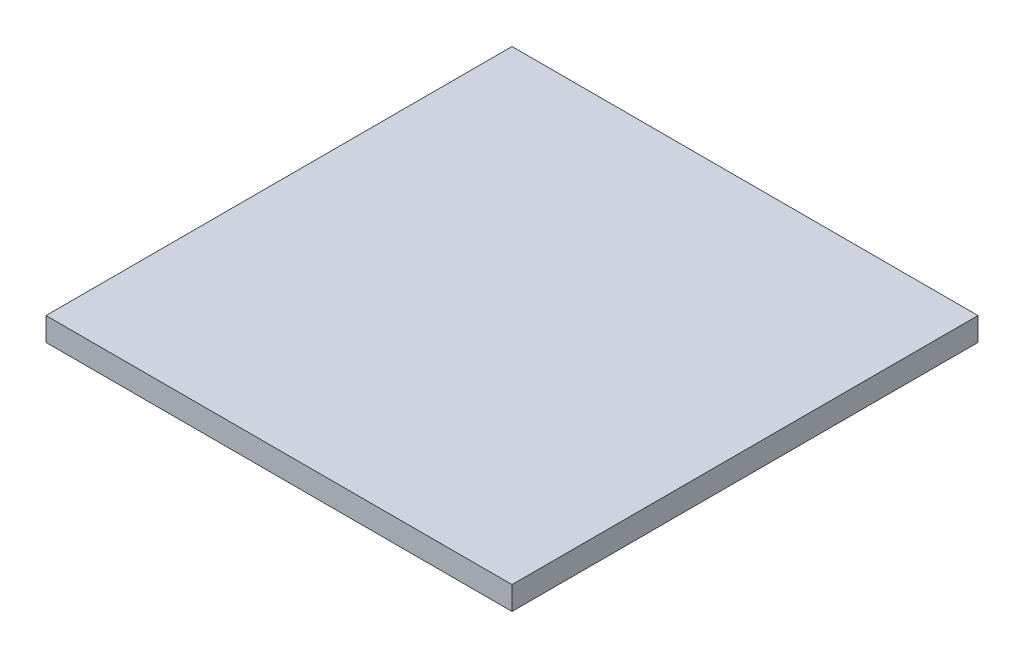
ISO-10303-21;
HEADER;
FILE_DESCRIPTION(('STEP AP214'),'2;1');
FILE_NAME('part.step','',(''),(''),'','','');
FILE_SCHEMA(('AUTOMOTIVE_DESIGN { 1 0 10303 214 1 1 1 1 }'));
ENDSEC;
DATA;
#1=APPLICATION_CONTEXT('core data for automotive mechanical design processes');
#2=APPLICATION_PROTOCOL_DEFINITION('international standard','automotive_design',2000,#1);
#3=PRODUCT_CONTEXT('',#1,'mechanical');
#4=PRODUCT('Part','Part','',(#3));
#5=PRODUCT_RELATED_PRODUCT_CATEGORY('part','',(#4));
#6=PRODUCT_DEFINITION_FORMATION('','',#4);
#7=PRODUCT_DEFINITION_CONTEXT('part definition',#1,'design');
#8=PRODUCT_DEFINITION('design','',#6,#7);
#9=PRODUCT_DEFINITION_SHAPE('','',#8);
#10=(LENGTH_UNIT() NAMED_UNIT(*) SI_UNIT(.MILLI.,.METRE.));
#11=(NAMED_UNIT(*) PLANE_ANGLE_UNIT() SI_UNIT($,.RADIAN.));
#12=(NAMED_UNIT(*) SI_UNIT($,.STERADIAN.) SOLID_ANGLE_UNIT());
#13=UNCERTAINTY_MEASURE_WITH_UNIT(LENGTH_MEASURE(1.E-05),#10,'distance_accuracy_value','');
#14=(GEOMETRIC_REPRESENTATION_CONTEXT(3) GLOBAL_UNCERTAINTY_ASSIGNED_CONTEXT((#13)) GLOBAL_UNIT_ASSIGNED_CONTEXT((#10,
#11,#12)) REPRESENTATION_CONTEXT('',''));
#15=CARTESIAN_POINT('',(0.,0.,0.));
#16=DIRECTION('',(0.,0.,1.));
#17=DIRECTION('',(1.,0.,0.));
#18=AXIS2_PLACEMENT_3D('',#15,#16,#17);
#19=CARTESIAN_POINT('',(1000.,-95.,1000.));
#20=DIRECTION('',(1.,0.,0.));
#21=DIRECTION('',(0.,0.,-1.));
#22=AXIS2_PLACEMENT_3D('',#19,#20,#21);
#23=PLANE('',#22);
#24=DIRECTION('',(0.,1.,0.));
#25=VECTOR('',#24,1.);
#26=CARTESIAN_POINT('',(1000.,-95.,-1000.));
#27=LINE('',#26,#25);
#28=CARTESIAN_POINT('',(1000.,-95.,-1000.));
#29=VERTEX_POINT('',#28);
#30=CARTESIAN_POINT('',(1000.,5.,-1000.));
#31=VERTEX_POINT('',#30);
#32=EDGE_CURVE('E52',#29,#31,#27,.T.);
#33=ORIENTED_EDGE('',*,*,#32,.T.);
#34=DIRECTION('',(0.,0.,-1.));
#35=VECTOR('',#34,1.);
#36=CARTESIAN_POINT('',(1000.,5.,1000.));
#37=LINE('',#36,#35);
#38=CARTESIAN_POINT('',(1000.,5.,1000.));
#39=VERTEX_POINT('',#38);
#40=EDGE_CURVE('E89',#39,#31,#37,.T.);
#41=ORIENTED_EDGE('',*,*,#40,.F.);
#42=DIRECTION('',(0.,1.,0.));
#43=VECTOR('',#42,1.);
#44=CARTESIAN_POINT('',(1000.,-95.,1000.));
#45=LINE('',#44,#43);
#46=CARTESIAN_POINT('',(1000.,-95.,1000.));
#47=VERTEX_POINT('',#46);
#48=EDGE_CURVE('E12',#47,#39,#45,.T.);
#49=ORIENTED_EDGE('',*,*,#48,.F.);
#50=DIRECTION('',(0.,0.,-1.));
#51=VECTOR('',#50,1.);
#52=CARTESIAN_POINT('',(1000.,-95.,1000.));
#53=LINE('',#52,#51);
#54=EDGE_CURVE('E90',#47,#29,#53,.T.);
#55=ORIENTED_EDGE('',*,*,#54,.T.);
#56=EDGE_LOOP('',(#33,#41,#49,#55));
#57=FACE_BOUND('',#56,.T.);
#58=ADVANCED_FACE('F49',(#57),#23,.T.);
#59=CARTESIAN_POINT('',(-1000.,-95.,1000.));
#60=DIRECTION('',(0.,0.,1.));
#61=DIRECTION('',(1.,0.,0.));
#62=AXIS2_PLACEMENT_3D('',#59,#60,#61);
#63=PLANE('',#62);
#64=ORIENTED_EDGE('',*,*,#48,.T.);
#65=DIRECTION('',(1.,0.,0.));
#66=VECTOR('',#65,1.);
#67=CARTESIAN_POINT('',(-1000.,5.,1000.));
#68=LINE('',#67,#66);
#69=CARTESIAN_POINT('',(-1000.,5.,1000.));
#70=VERTEX_POINT('',#69);
#71=EDGE_CURVE('E106',#70,#39,#68,.T.);
#72=ORIENTED_EDGE('',*,*,#71,.F.);
#73=DIRECTION('',(0.,1.,0.));
#74=VECTOR('',#73,1.);
#75=CARTESIAN_POINT('',(-1000.,-95.,1000.));
#76=LINE('',#75,#74);
#77=CARTESIAN_POINT('',(-1000.,-95.,1000.));
#78=VERTEX_POINT('',#77);
#79=EDGE_CURVE('E57',#78,#70,#76,.T.);
#80=ORIENTED_EDGE('',*,*,#79,.F.);
#81=DIRECTION('',(1.,0.,0.));
#82=VECTOR('',#81,1.);
#83=CARTESIAN_POINT('',(-1000.,-95.,1000.));
#84=LINE('',#83,#82);
#85=EDGE_CURVE('E95',#78,#47,#84,.T.);
#86=ORIENTED_EDGE('',*,*,#85,.T.);
#87=EDGE_LOOP('',(#64,#72,#80,#86));
#88=FACE_BOUND('',#87,.T.);
#89=ADVANCED_FACE('F121',(#88),#63,.T.);
#90=CARTESIAN_POINT('',(-1000.,-95.,1000.));
#91=DIRECTION('',(-1.,0.,0.));
#92=DIRECTION('',(0.,0.,1.));
#93=AXIS2_PLACEMENT_3D('',#90,#91,#92);
#94=PLANE('',#93);
#95=ORIENTED_EDGE('',*,*,#79,.T.);
#96=DIRECTION('',(0.,0.,1.));
#97=VECTOR('',#96,1.);
#98=CARTESIAN_POINT('',(-1000.,5.,1000.));
#99=LINE('',#98,#97);
#100=CARTESIAN_POINT('',(-1000.,5.,-1000.));
#101=VERTEX_POINT('',#100);
#102=EDGE_CURVE('E102',#101,#70,#99,.T.);
#103=ORIENTED_EDGE('',*,*,#102,.F.);
#104=DIRECTION('',(0.,1.,0.));
#105=VECTOR('',#104,1.);
#106=CARTESIAN_POINT('',(-1000.,-95.,-1000.));
#107=LINE('',#106,#105);
#108=CARTESIAN_POINT('',(-1000.,-95.,-1000.));
#109=VERTEX_POINT('',#108);
#110=EDGE_CURVE('E94',#109,#101,#107,.T.);
#111=ORIENTED_EDGE('',*,*,#110,.F.);
#112=DIRECTION('',(0.,0.,1.));
#113=VECTOR('',#112,1.);
#114=CARTESIAN_POINT('',(-1000.,-95.,1000.));
#115=LINE('',#114,#113);
#116=EDGE_CURVE('E114',#109,#78,#115,.T.);
#117=ORIENTED_EDGE('',*,*,#116,.T.);
#118=EDGE_LOOP('',(#95,#103,#111,#117));
#119=FACE_BOUND('',#118,.T.);
#120=ADVANCED_FACE('F118',(#119),#94,.T.);
#121=CARTESIAN_POINT('',(-1000.,-95.,-1000.));
#122=DIRECTION('',(0.,0.,-1.));
#123=DIRECTION('',(-1.,0.,0.));
#124=AXIS2_PLACEMENT_3D('',#121,#122,#123);
#125=PLANE('',#124);
#126=ORIENTED_EDGE('',*,*,#110,.T.);
#127=DIRECTION('',(-1.,0.,0.));
#128=VECTOR('',#127,1.);
#129=CARTESIAN_POINT('',(-1000.,5.,-1000.));
#130=LINE('',#129,#128);
#131=EDGE_CURVE('E97',#31,#101,#130,.T.);
#132=ORIENTED_EDGE('',*,*,#131,.F.);
#133=ORIENTED_EDGE('',*,*,#32,.F.);
#134=DIRECTION('',(-1.,0.,0.));
#135=VECTOR('',#134,1.);
#136=CARTESIAN_POINT('',(-1000.,-95.,-1000.));
#137=LINE('',#136,#135);
#138=EDGE_CURVE('E112',#29,#109,#137,.T.);
#139=ORIENTED_EDGE('',*,*,#138,.T.);
#140=EDGE_LOOP('',(#126,#132,#133,#139));
#141=FACE_BOUND('',#140,.T.);
#142=ADVANCED_FACE('F98',(#141),#125,.T.);
#143=CARTESIAN_POINT('',(0.,-95.,0.));
#144=DIRECTION('',(0.,-1.,0.));
#145=DIRECTION('',(0.,0.,-1.));
#146=AXIS2_PLACEMENT_3D('',#143,#144,#145);
#147=PLANE('',#146);
#148=ORIENTED_EDGE('',*,*,#54,.F.);
#149=ORIENTED_EDGE('',*,*,#85,.F.);
#150=ORIENTED_EDGE('',*,*,#116,.F.);
#151=ORIENTED_EDGE('',*,*,#138,.F.);
#152=EDGE_LOOP('',(#148,#149,#150,#151));
#153=FACE_BOUND('',#152,.T.);
#154=ADVANCED_FACE('F123',(#153),#147,.T.);
#155=CARTESIAN_POINT('',(0.,5.,0.));
#156=DIRECTION('',(0.,-1.,0.));
#157=DIRECTION('',(0.,0.,-1.));
#158=AXIS2_PLACEMENT_3D('',#155,#156,#157);
#159=PLANE('',#158);
#160=ORIENTED_EDGE('',*,*,#40,.T.);
#161=ORIENTED_EDGE('',*,*,#131,.T.);
#162=ORIENTED_EDGE('',*,*,#102,.T.);
#163=ORIENTED_EDGE('',*,*,#71,.T.);
#164=EDGE_LOOP('',(#160,#161,#162,#163));
#165=FACE_BOUND('',#164,.T.);
#166=ADVANCED_FACE('F105',(#165),#159,.F.);
#167=CLOSED_SHELL('',(#58,#89,#120,#142,#154,#166));
#168=MANIFOLD_SOLID_BREP('B2',#167);
#169=CARTESIAN_POINT('',(1000.,-95.,1000.));
#170=DIRECTION('',(1.,0.,0.));
#171=DIRECTION('',(0.,0.,-1.));
#172=AXIS2_PLACEMENT_3D('',#169,#170,#171);
#173=PLANE('',#172);
#174=DIRECTION('',(0.,1.,0.));
#175=VECTOR('',#174,1.);
#176=CARTESIAN_POINT('',(1000.,-95.,-1000.));
#177=LINE('',#176,#175);
#178=CARTESIAN_POINT('',(1000.,-95.,-1000.));
#179=VERTEX_POINT('',#178);
#180=CARTESIAN_POINT('',(1000.,5.,-1000.));
#181=VERTEX_POINT('',#180);
#182=EDGE_CURVE('E176',#179,#181,#177,.T.);
#183=ORIENTED_EDGE('',*,*,#182,.T.);
#184=DIRECTION('',(0.,0.,-1.));
#185=VECTOR('',#184,1.);
#186=CARTESIAN_POINT('',(1000.,5.,1000.));
#187=LINE('',#186,#185);
#188=CARTESIAN_POINT('',(1000.,5.,1000.));
#189=VERTEX_POINT('',#188);
#190=EDGE_CURVE('E213',#189,#181,#187,.T.);
#191=ORIENTED_EDGE('',*,*,#190,.F.);
#192=DIRECTION('',(0.,1.,0.));
#193=VECTOR('',#192,1.);
#194=CARTESIAN_POINT('',(1000.,-95.,1000.));
#195=LINE('',#194,#193);
#196=CARTESIAN_POINT('',(1000.,-95.,1000.));
#197=VERTEX_POINT('',#196);
#198=EDGE_CURVE('E47',#197,#189,#195,.T.);
#199=ORIENTED_EDGE('',*,*,#198,.F.);
#200=DIRECTION('',(0.,0.,-1.));
#201=VECTOR('',#200,1.);
#202=CARTESIAN_POINT('',(1000.,-95.,1000.));
#203=LINE('',#202,#201);
#204=EDGE_CURVE('E214',#197,#179,#203,.T.);
#205=ORIENTED_EDGE('',*,*,#204,.T.);
#206=EDGE_LOOP('',(#183,#191,#199,#205));
#207=FACE_BOUND('',#206,.T.);
#208=ADVANCED_FACE('F173',(#207),#173,.T.);
#209=CARTESIAN_POINT('',(-1000.,-95.,1000.));
#210=DIRECTION('',(0.,0.,1.));
#211=DIRECTION('',(1.,0.,0.));
#212=AXIS2_PLACEMENT_3D('',#209,#210,#211);
#213=PLANE('',#212);
#214=ORIENTED_EDGE('',*,*,#198,.T.);
#215=DIRECTION('',(1.,0.,0.));
#216=VECTOR('',#215,1.);
#217=CARTESIAN_POINT('',(-1000.,5.,1000.));
#218=LINE('',#217,#216);
#219=CARTESIAN_POINT('',(-1000.,5.,1000.));
#220=VERTEX_POINT('',#219);
#221=EDGE_CURVE('E230',#220,#189,#218,.T.);
#222=ORIENTED_EDGE('',*,*,#221,.F.);
#223=DIRECTION('',(0.,1.,0.));
#224=VECTOR('',#223,1.);
#225=CARTESIAN_POINT('',(-1000.,-95.,1000.));
#226=LINE('',#225,#224);
#227=CARTESIAN_POINT('',(-1000.,-95.,1000.));
#228=VERTEX_POINT('',#227);
#229=EDGE_CURVE('E181',#228,#220,#226,.T.);
#230=ORIENTED_EDGE('',*,*,#229,.F.);
#231=DIRECTION('',(1.,0.,0.));
#232=VECTOR('',#231,1.);
#233=CARTESIAN_POINT('',(-1000.,-95.,1000.));
#234=LINE('',#233,#232);
#235=EDGE_CURVE('E219',#228,#197,#234,.T.);
#236=ORIENTED_EDGE('',*,*,#235,.T.);
#237=EDGE_LOOP('',(#214,#222,#230,#236));
#238=FACE_BOUND('',#237,.T.);
#239=ADVANCED_FACE('F245',(#238),#213,.T.);
#240=CARTESIAN_POINT('',(-1000.,-95.,1000.));
#241=DIRECTION('',(-1.,0.,0.));
#242=DIRECTION('',(0.,0.,1.));
#243=AXIS2_PLACEMENT_3D('',#240,#241,#242);
#244=PLANE('',#243);
#245=ORIENTED_EDGE('',*,*,#229,.T.);
#246=DIRECTION('',(0.,0.,1.));
#247=VECTOR('',#246,1.);
#248=CARTESIAN_POINT('',(-1000.,5.,1000.));
#249=LINE('',#248,#247);
#250=CARTESIAN_POINT('',(-1000.,5.,-1000.));
#251=VERTEX_POINT('',#250);
#252=EDGE_CURVE('E226',#251,#220,#249,.T.);
#253=ORIENTED_EDGE('',*,*,#252,.F.);
#254=DIRECTION('',(0.,1.,0.));
#255=VECTOR('',#254,1.);
#256=CARTESIAN_POINT('',(-1000.,-95.,-1000.));
#257=LINE('',#256,#255);
#258=CARTESIAN_POINT('',(-1000.,-95.,-1000.));
#259=VERTEX_POINT('',#258);
#260=EDGE_CURVE('E218',#259,#251,#257,.T.);
#261=ORIENTED_EDGE('',*,*,#260,.F.);
#262=DIRECTION('',(0.,0.,1.));
#263=VECTOR('',#262,1.);
#264=CARTESIAN_POINT('',(-1000.,-95.,1000.));
#265=LINE('',#264,#263);
#266=EDGE_CURVE('E238',#259,#228,#265,.T.);
#267=ORIENTED_EDGE('',*,*,#266,.T.);
#268=EDGE_LOOP('',(#245,#253,#261,#267));
#269=FACE_BOUND('',#268,.T.);
#270=ADVANCED_FACE('F242',(#269),#244,.T.);
#271=CARTESIAN_POINT('',(-1000.,-95.,-1000.));
#272=DIRECTION('',(0.,0.,-1.));
#273=DIRECTION('',(-1.,0.,0.));
#274=AXIS2_PLACEMENT_3D('',#271,#272,#273);
#275=PLANE('',#274);
#276=ORIENTED_EDGE('',*,*,#260,.T.);
#277=DIRECTION('',(-1.,0.,0.));
#278=VECTOR('',#277,1.);
#279=CARTESIAN_POINT('',(-1000.,5.,-1000.));
#280=LINE('',#279,#278);
#281=EDGE_CURVE('E221',#181,#251,#280,.T.);
#282=ORIENTED_EDGE('',*,*,#281,.F.);
#283=ORIENTED_EDGE('',*,*,#182,.F.);
#284=DIRECTION('',(-1.,0.,0.));
#285=VECTOR('',#284,1.);
#286=CARTESIAN_POINT('',(-1000.,-95.,-1000.));
#287=LINE('',#286,#285);
#288=EDGE_CURVE('E236',#179,#259,#287,.T.);
#289=ORIENTED_EDGE('',*,*,#288,.T.);
#290=EDGE_LOOP('',(#276,#282,#283,#289));
#291=FACE_BOUND('',#290,.T.);
#292=ADVANCED_FACE('F222',(#291),#275,.T.);
#293=CARTESIAN_POINT('',(0.,-95.,0.));
#294=DIRECTION('',(0.,-1.,0.));
#295=DIRECTION('',(0.,0.,-1.));
#296=AXIS2_PLACEMENT_3D('',#293,#294,#295);
#297=PLANE('',#296);
#298=ORIENTED_EDGE('',*,*,#204,.F.);
#299=ORIENTED_EDGE('',*,*,#235,.F.);
#300=ORIENTED_EDGE('',*,*,#266,.F.);
#301=ORIENTED_EDGE('',*,*,#288,.F.);
#302=EDGE_LOOP('',(#298,#299,#300,#301));
#303=FACE_BOUND('',#302,.T.);
#304=ADVANCED_FACE('F247',(#303),#297,.T.);
#305=CARTESIAN_POINT('',(0.,5.,0.));
#306=DIRECTION('',(0.,-1.,0.));
#307=DIRECTION('',(0.,0.,-1.));
#308=AXIS2_PLACEMENT_3D('',#305,#306,#307);
#309=PLANE('',#308);
#310=ORIENTED_EDGE('',*,*,#190,.T.);
#311=ORIENTED_EDGE('',*,*,#281,.T.);
#312=ORIENTED_EDGE('',*,*,#252,.T.);
#313=ORIENTED_EDGE('',*,*,#221,.T.);
#314=EDGE_LOOP('',(#310,#311,#312,#313));
#315=FACE_BOUND('',#314,.T.);
#316=ADVANCED_FACE('F229',(#315),#309,.F.);
#317=CLOSED_SHELL('',(#208,#239,#270,#292,#304,#316));
#318=MANIFOLD_SOLID_BREP('B6',#317);
#319=ADVANCED_BREP_SHAPE_REPRESENTATION('',(#18,#168,#318),#14);
#320=SHAPE_DEFINITION_REPRESENTATION(#9,#319);
ENDSEC;
END-ISO-10303-21;
